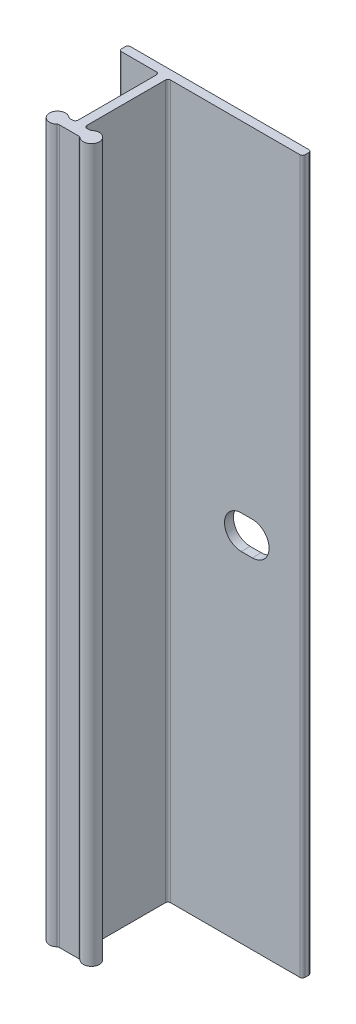
ISO-10303-21;
HEADER;
FILE_DESCRIPTION(('STEP AP214'),'2;1');
FILE_NAME('part.step','',(''),(''),'','','');
FILE_SCHEMA(('AUTOMOTIVE_DESIGN { 1 0 10303 214 1 1 1 1 }'));
ENDSEC;
DATA;
#1=APPLICATION_CONTEXT('core data for automotive mechanical design processes');
#2=APPLICATION_PROTOCOL_DEFINITION('international standard','automotive_design',2000,#1);
#3=PRODUCT_CONTEXT('',#1,'mechanical');
#4=PRODUCT('Part','Part','',(#3));
#5=PRODUCT_RELATED_PRODUCT_CATEGORY('part','',(#4));
#6=PRODUCT_DEFINITION_FORMATION('','',#4);
#7=PRODUCT_DEFINITION_CONTEXT('part definition',#1,'design');
#8=PRODUCT_DEFINITION('design','',#6,#7);
#9=PRODUCT_DEFINITION_SHAPE('','',#8);
#10=(LENGTH_UNIT() NAMED_UNIT(*) SI_UNIT(.MILLI.,.METRE.));
#11=(NAMED_UNIT(*) PLANE_ANGLE_UNIT() SI_UNIT($,.RADIAN.));
#12=(NAMED_UNIT(*) SI_UNIT($,.STERADIAN.) SOLID_ANGLE_UNIT());
#13=UNCERTAINTY_MEASURE_WITH_UNIT(LENGTH_MEASURE(1.E-05),#10,'distance_accuracy_value','');
#14=(GEOMETRIC_REPRESENTATION_CONTEXT(3) GLOBAL_UNCERTAINTY_ASSIGNED_CONTEXT((#13)) GLOBAL_UNIT_ASSIGNED_CONTEXT((#10,
#11,#12)) REPRESENTATION_CONTEXT('',''));
#15=CARTESIAN_POINT('',(0.,0.,0.));
#16=DIRECTION('',(0.,0.,1.));
#17=DIRECTION('',(1.,0.,0.));
#18=AXIS2_PLACEMENT_3D('',#15,#16,#17);
#19=CARTESIAN_POINT('',(-5.96900000000001,50.8,0.381));
#20=DIRECTION('',(0.,-1.,0.));
#21=DIRECTION('',(0.,0.,-1.));
#22=AXIS2_PLACEMENT_3D('',#19,#20,#21);
#23=CYLINDRICAL_SURFACE('',#22,0.381);
#24=CARTESIAN_POINT('',(-5.96900000000001,-50.8,0.381));
#25=DIRECTION('',(0.,1.,0.));
#26=DIRECTION('',(0.,0.,-1.));
#27=AXIS2_PLACEMENT_3D('',#24,#25,#26);
#28=CIRCLE('',#27,0.381);
#29=CARTESIAN_POINT('',(-5.96900000000001,-50.8,0.));
#30=VERTEX_POINT('',#29);
#31=CARTESIAN_POINT('',(-6.35000000000001,-50.8,0.381000000000002));
#32=VERTEX_POINT('',#31);
#33=EDGE_CURVE('E263',#30,#32,#28,.T.);
#34=ORIENTED_EDGE('',*,*,#33,.T.);
#35=DIRECTION('',(0.,-1.,0.));
#36=VECTOR('',#35,1.);
#37=CARTESIAN_POINT('',(-6.35000000000001,50.8,0.381000000000002));
#38=LINE('',#37,#36);
#39=CARTESIAN_POINT('',(-6.35000000000001,50.8,0.381000000000002));
#40=VERTEX_POINT('',#39);
#41=EDGE_CURVE('E13',#40,#32,#38,.T.);
#42=ORIENTED_EDGE('',*,*,#41,.F.);
#43=CARTESIAN_POINT('',(-5.96900000000001,50.8,0.381));
#44=DIRECTION('',(0.,1.,0.));
#45=DIRECTION('',(0.,0.,-1.));
#46=AXIS2_PLACEMENT_3D('',#43,#44,#45);
#47=CIRCLE('',#46,0.381);
#48=CARTESIAN_POINT('',(-5.96900000000001,50.8,0.));
#49=VERTEX_POINT('',#48);
#50=EDGE_CURVE('E267',#49,#40,#47,.T.);
#51=ORIENTED_EDGE('',*,*,#50,.F.);
#52=DIRECTION('',(0.,-1.,0.));
#53=VECTOR('',#52,1.);
#54=CARTESIAN_POINT('',(-5.96900000000001,50.8,0.));
#55=LINE('',#54,#53);
#56=EDGE_CURVE('E317',#49,#30,#55,.T.);
#57=ORIENTED_EDGE('',*,*,#56,.T.);
#58=EDGE_LOOP('',(#34,#42,#51,#57));
#59=FACE_BOUND('',#58,.T.);
#60=ADVANCED_FACE('F46',(#59),#23,.T.);
#61=CARTESIAN_POINT('',(-6.35000000000001,50.8,0.889000000000004));
#62=DIRECTION('',(1.,0.,0.));
#63=DIRECTION('',(0.,0.,-1.));
#64=AXIS2_PLACEMENT_3D('',#61,#62,#63);
#65=PLANE('',#64);
#66=DIRECTION('',(0.,0.,1.));
#67=VECTOR('',#66,1.);
#68=CARTESIAN_POINT('',(-6.35000000000001,-50.8,0.889000000000004));
#69=LINE('',#68,#67);
#70=CARTESIAN_POINT('',(-6.35000000000001,-50.8,0.889000000000004));
#71=VERTEX_POINT('',#70);
#72=EDGE_CURVE('E320',#32,#71,#69,.T.);
#73=ORIENTED_EDGE('',*,*,#72,.T.);
#74=DIRECTION('',(0.,-1.,0.));
#75=VECTOR('',#74,1.);
#76=CARTESIAN_POINT('',(-6.35000000000001,50.8,0.889000000000004));
#77=LINE('',#76,#75);
#78=CARTESIAN_POINT('',(-6.35000000000001,50.8,0.889000000000004));
#79=VERTEX_POINT('',#78);
#80=EDGE_CURVE('E53',#79,#71,#77,.T.);
#81=ORIENTED_EDGE('',*,*,#80,.F.);
#82=DIRECTION('',(0.,0.,1.));
#83=VECTOR('',#82,1.);
#84=CARTESIAN_POINT('',(-6.35000000000001,50.8,0.889000000000004));
#85=LINE('',#84,#83);
#86=EDGE_CURVE('E270',#40,#79,#85,.T.);
#87=ORIENTED_EDGE('',*,*,#86,.F.);
#88=ORIENTED_EDGE('',*,*,#41,.T.);
#89=EDGE_LOOP('',(#73,#81,#87,#88));
#90=FACE_BOUND('',#89,.T.);
#91=ADVANCED_FACE('F457',(#90),#65,.F.);
#92=CARTESIAN_POINT('',(-5.96900000000001,50.8,0.889000000000004));
#93=DIRECTION('',(0.,-1.,0.));
#94=DIRECTION('',(0.,0.,-1.));
#95=AXIS2_PLACEMENT_3D('',#92,#93,#94);
#96=CYLINDRICAL_SURFACE('',#95,0.381000000000001);
#97=CARTESIAN_POINT('',(-5.96900000000001,-50.8,0.889000000000004));
#98=DIRECTION('',(0.,1.,0.));
#99=DIRECTION('',(0.,0.,-1.));
#100=AXIS2_PLACEMENT_3D('',#97,#98,#99);
#101=CIRCLE('',#100,0.381000000000001);
#102=CARTESIAN_POINT('',(-5.96900000000001,-50.8,1.27000000000001));
#103=VERTEX_POINT('',#102);
#104=EDGE_CURVE('E322',#71,#103,#101,.T.);
#105=ORIENTED_EDGE('',*,*,#104,.T.);
#106=DIRECTION('',(0.,-1.,0.));
#107=VECTOR('',#106,1.);
#108=CARTESIAN_POINT('',(-5.96900000000001,50.8,1.27000000000001));
#109=LINE('',#108,#107);
#110=CARTESIAN_POINT('',(-5.96900000000001,50.8,1.27000000000001));
#111=VERTEX_POINT('',#110);
#112=EDGE_CURVE('E427',#111,#103,#109,.T.);
#113=ORIENTED_EDGE('',*,*,#112,.F.);
#114=CARTESIAN_POINT('',(-5.96900000000001,50.8,0.889000000000004));
#115=DIRECTION('',(0.,1.,0.));
#116=DIRECTION('',(0.,0.,-1.));
#117=AXIS2_PLACEMENT_3D('',#114,#115,#116);
#118=CIRCLE('',#117,0.381000000000001);
#119=EDGE_CURVE('E273',#79,#111,#118,.T.);
#120=ORIENTED_EDGE('',*,*,#119,.F.);
#121=ORIENTED_EDGE('',*,*,#80,.T.);
#122=EDGE_LOOP('',(#105,#113,#120,#121));
#123=FACE_BOUND('',#122,.T.);
#124=ADVANCED_FACE('F434',(#123),#96,.T.);
#125=CARTESIAN_POINT('',(-1.016,50.8,1.27));
#126=DIRECTION('',(0.,0.,-1.));
#127=DIRECTION('',(-1.,0.,0.));
#128=AXIS2_PLACEMENT_3D('',#125,#126,#127);
#129=PLANE('',#128);
#130=DIRECTION('',(1.,0.,0.));
#131=VECTOR('',#130,1.);
#132=CARTESIAN_POINT('',(-1.016,-50.8,1.27));
#133=LINE('',#132,#131);
#134=CARTESIAN_POINT('',(-1.016,-50.8,1.27));
#135=VERTEX_POINT('',#134);
#136=EDGE_CURVE('E324',#103,#135,#133,.T.);
#137=ORIENTED_EDGE('',*,*,#136,.T.);
#138=DIRECTION('',(0.,-1.,0.));
#139=VECTOR('',#138,1.);
#140=CARTESIAN_POINT('',(-1.016,50.8,1.27));
#141=LINE('',#140,#139);
#142=CARTESIAN_POINT('',(-1.016,50.8,1.27));
#143=VERTEX_POINT('',#142);
#144=EDGE_CURVE('E424',#143,#135,#141,.T.);
#145=ORIENTED_EDGE('',*,*,#144,.F.);
#146=DIRECTION('',(1.,0.,0.));
#147=VECTOR('',#146,1.);
#148=CARTESIAN_POINT('',(-1.016,50.8,1.27));
#149=LINE('',#148,#147);
#150=EDGE_CURVE('E275',#111,#143,#149,.T.);
#151=ORIENTED_EDGE('',*,*,#150,.F.);
#152=ORIENTED_EDGE('',*,*,#112,.T.);
#153=EDGE_LOOP('',(#137,#145,#151,#152));
#154=FACE_BOUND('',#153,.T.);
#155=ADVANCED_FACE('F445',(#154),#129,.F.);
#156=CARTESIAN_POINT('',(-1.016,50.8,1.651));
#157=DIRECTION('',(0.,-1.,0.));
#158=DIRECTION('',(0.,0.,-1.));
#159=AXIS2_PLACEMENT_3D('',#156,#157,#158);
#160=CYLINDRICAL_SURFACE('',#159,0.381);
#161=CARTESIAN_POINT('',(-1.016,-50.8,1.651));
#162=DIRECTION('',(0.,-1.,0.));
#163=DIRECTION('',(0.,0.,-1.));
#164=AXIS2_PLACEMENT_3D('',#161,#162,#163);
#165=CIRCLE('',#164,0.381);
#166=CARTESIAN_POINT('',(-0.634999999999999,-50.8,1.651));
#167=VERTEX_POINT('',#166);
#168=EDGE_CURVE('E326',#135,#167,#165,.T.);
#169=ORIENTED_EDGE('',*,*,#168,.T.);
#170=DIRECTION('',(0.,-1.,0.));
#171=VECTOR('',#170,1.);
#172=CARTESIAN_POINT('',(-0.634999999999999,50.8,1.651));
#173=LINE('',#172,#171);
#174=CARTESIAN_POINT('',(-0.634999999999999,50.8,1.651));
#175=VERTEX_POINT('',#174);
#176=EDGE_CURVE('E421',#175,#167,#173,.T.);
#177=ORIENTED_EDGE('',*,*,#176,.F.);
#178=CARTESIAN_POINT('',(-1.016,50.8,1.651));
#179=DIRECTION('',(0.,-1.,0.));
#180=DIRECTION('',(0.,0.,-1.));
#181=AXIS2_PLACEMENT_3D('',#178,#179,#180);
#182=CIRCLE('',#181,0.381);
#183=EDGE_CURVE('E277',#143,#175,#182,.T.);
#184=ORIENTED_EDGE('',*,*,#183,.F.);
#185=ORIENTED_EDGE('',*,*,#144,.T.);
#186=EDGE_LOOP('',(#169,#177,#184,#185));
#187=FACE_BOUND('',#186,.T.);
#188=ADVANCED_FACE('F449',(#187),#160,.F.);
#189=CARTESIAN_POINT('',(-0.634999999999999,50.8,1.651));
#190=DIRECTION('',(1.,0.,0.));
#191=DIRECTION('',(0.,0.,-1.));
#192=AXIS2_PLACEMENT_3D('',#189,#190,#191);
#193=PLANE('',#192);
#194=DIRECTION('',(0.,0.,1.));
#195=VECTOR('',#194,1.);
#196=CARTESIAN_POINT('',(-0.634999999999999,-50.8,1.651));
#197=LINE('',#196,#195);
#198=CARTESIAN_POINT('',(-0.634999999999998,-50.8,12.827));
#199=VERTEX_POINT('',#198);
#200=EDGE_CURVE('E328',#167,#199,#197,.T.);
#201=ORIENTED_EDGE('',*,*,#200,.T.);
#202=DIRECTION('',(0.,-1.,0.));
#203=VECTOR('',#202,1.);
#204=CARTESIAN_POINT('',(-0.634999999999998,50.8,12.827));
#205=LINE('',#204,#203);
#206=CARTESIAN_POINT('',(-0.634999999999998,50.8,12.827));
#207=VERTEX_POINT('',#206);
#208=EDGE_CURVE('E418',#207,#199,#205,.T.);
#209=ORIENTED_EDGE('',*,*,#208,.F.);
#210=DIRECTION('',(0.,0.,1.));
#211=VECTOR('',#210,1.);
#212=CARTESIAN_POINT('',(-0.634999999999999,50.8,1.651));
#213=LINE('',#212,#211);
#214=EDGE_CURVE('E279',#175,#207,#213,.T.);
#215=ORIENTED_EDGE('',*,*,#214,.F.);
#216=ORIENTED_EDGE('',*,*,#176,.T.);
#217=EDGE_LOOP('',(#201,#209,#215,#216));
#218=FACE_BOUND('',#217,.T.);
#219=ADVANCED_FACE('F548',(#218),#193,.F.);
#220=CARTESIAN_POINT('',(-1.016,50.8,12.827));
#221=DIRECTION('',(0.,-1.,0.));
#222=DIRECTION('',(0.,0.,-1.));
#223=AXIS2_PLACEMENT_3D('',#220,#221,#222);
#224=CYLINDRICAL_SURFACE('',#223,0.381);
#225=CARTESIAN_POINT('',(-1.016,-50.8,12.827));
#226=DIRECTION('',(0.,-1.,0.));
#227=DIRECTION('',(0.,0.,-1.));
#228=AXIS2_PLACEMENT_3D('',#225,#226,#227);
#229=CIRCLE('',#228,0.381);
#230=CARTESIAN_POINT('',(-1.016,-50.8,13.208));
#231=VERTEX_POINT('',#230);
#232=EDGE_CURVE('E330',#199,#231,#229,.T.);
#233=ORIENTED_EDGE('',*,*,#232,.T.);
#234=DIRECTION('',(0.,-1.,0.));
#235=VECTOR('',#234,1.);
#236=CARTESIAN_POINT('',(-1.016,50.8,13.208));
#237=LINE('',#236,#235);
#238=CARTESIAN_POINT('',(-1.016,50.8,13.208));
#239=VERTEX_POINT('',#238);
#240=EDGE_CURVE('E415',#239,#231,#237,.T.);
#241=ORIENTED_EDGE('',*,*,#240,.F.);
#242=CARTESIAN_POINT('',(-1.016,50.8,12.827));
#243=DIRECTION('',(0.,-1.,0.));
#244=DIRECTION('',(0.,0.,-1.));
#245=AXIS2_PLACEMENT_3D('',#242,#243,#244);
#246=CIRCLE('',#245,0.381);
#247=EDGE_CURVE('E281',#207,#239,#246,.T.);
#248=ORIENTED_EDGE('',*,*,#247,.F.);
#249=ORIENTED_EDGE('',*,*,#208,.T.);
#250=EDGE_LOOP('',(#233,#241,#248,#249));
#251=FACE_BOUND('',#250,.T.);
#252=ADVANCED_FACE('F546',(#251),#224,.F.);
#253=CARTESIAN_POINT('',(-1.40496875048439,50.8,13.208));
#254=DIRECTION('',(0.,0.,1.));
#255=DIRECTION('',(1.,0.,0.));
#256=AXIS2_PLACEMENT_3D('',#253,#254,#255);
#257=PLANE('',#256);
#258=DIRECTION('',(-1.,0.,0.));
#259=VECTOR('',#258,1.);
#260=CARTESIAN_POINT('',(-1.40496875048439,-50.8,13.208));
#261=LINE('',#260,#259);
#262=CARTESIAN_POINT('',(-1.40496875048439,-50.8,13.208));
#263=VERTEX_POINT('',#262);
#264=EDGE_CURVE('E332',#231,#263,#261,.T.);
#265=ORIENTED_EDGE('',*,*,#264,.T.);
#266=DIRECTION('',(0.,-1.,0.));
#267=VECTOR('',#266,1.);
#268=CARTESIAN_POINT('',(-1.40496875048439,50.8,13.208));
#269=LINE('',#268,#267);
#270=CARTESIAN_POINT('',(-1.40496875048439,50.8,13.208));
#271=VERTEX_POINT('',#270);
#272=EDGE_CURVE('E412',#271,#263,#269,.T.);
#273=ORIENTED_EDGE('',*,*,#272,.F.);
#274=DIRECTION('',(-1.,0.,0.));
#275=VECTOR('',#274,1.);
#276=CARTESIAN_POINT('',(-1.40496875048439,50.8,13.208));
#277=LINE('',#276,#275);
#278=EDGE_CURVE('E283',#239,#271,#277,.T.);
#279=ORIENTED_EDGE('',*,*,#278,.F.);
#280=ORIENTED_EDGE('',*,*,#240,.T.);
#281=EDGE_LOOP('',(#265,#273,#279,#280));
#282=FACE_BOUND('',#281,.T.);
#283=ADVANCED_FACE('F542',(#282),#257,.F.);
#284=CARTESIAN_POINT('',(-1.40496875048439,50.8,12.827));
#285=DIRECTION('',(0.,-1.,0.));
#286=DIRECTION('',(0.,0.,-1.));
#287=AXIS2_PLACEMENT_3D('',#284,#285,#286);
#288=CYLINDRICAL_SURFACE('',#287,0.381);
#289=CARTESIAN_POINT('',(-1.40496875048439,-50.8,12.827));
#290=DIRECTION('',(0.,-1.,0.));
#291=DIRECTION('',(0.,0.,-1.));
#292=AXIS2_PLACEMENT_3D('',#289,#290,#291);
#293=CIRCLE('',#292,0.381);
#294=CARTESIAN_POINT('',(-1.65697656286329,-50.8,13.11275));
#295=VERTEX_POINT('',#294);
#296=EDGE_CURVE('E334',#263,#295,#293,.T.);
#297=ORIENTED_EDGE('',*,*,#296,.T.);
#298=DIRECTION('',(0.,-1.,0.));
#299=VECTOR('',#298,1.);
#300=CARTESIAN_POINT('',(-1.65697656286329,50.8,13.11275));
#301=LINE('',#300,#299);
#302=CARTESIAN_POINT('',(-1.65697656286329,50.8,13.11275));
#303=VERTEX_POINT('',#302);
#304=EDGE_CURVE('E409',#303,#295,#301,.T.);
#305=ORIENTED_EDGE('',*,*,#304,.F.);
#306=CARTESIAN_POINT('',(-1.40496875048439,50.8,12.827));
#307=DIRECTION('',(0.,-1.,0.));
#308=DIRECTION('',(0.,0.,-1.));
#309=AXIS2_PLACEMENT_3D('',#306,#307,#308);
#310=CIRCLE('',#309,0.381);
#311=EDGE_CURVE('E285',#271,#303,#310,.T.);
#312=ORIENTED_EDGE('',*,*,#311,.F.);
#313=ORIENTED_EDGE('',*,*,#272,.T.);
#314=EDGE_LOOP('',(#297,#305,#312,#313));
#315=FACE_BOUND('',#314,.T.);
#316=ADVANCED_FACE('F537',(#315),#288,.F.);
#317=CARTESIAN_POINT('',(-2.413,50.8,13.97));
#318=DIRECTION('',(0.,-1.,0.));
#319=DIRECTION('',(0.,0.,-1.));
#320=AXIS2_PLACEMENT_3D('',#317,#318,#319);
#321=CYLINDRICAL_SURFACE('',#320,1.143);
#322=CARTESIAN_POINT('',(-2.413,-50.8,13.97));
#323=DIRECTION('',(0.,1.,0.));
#324=DIRECTION('',(0.,0.,1.));
#325=AXIS2_PLACEMENT_3D('',#322,#323,#324);
#326=CIRCLE('',#325,1.143);
#327=CARTESIAN_POINT('',(-1.65697656286329,-50.8,14.82725));
#328=VERTEX_POINT('',#327);
#329=EDGE_CURVE('E336',#295,#328,#326,.T.);
#330=ORIENTED_EDGE('',*,*,#329,.T.);
#331=DIRECTION('',(0.,-1.,0.));
#332=VECTOR('',#331,1.);
#333=CARTESIAN_POINT('',(-1.65697656286329,50.8,14.82725));
#334=LINE('',#333,#332);
#335=CARTESIAN_POINT('',(-1.65697656286329,50.8,14.82725));
#336=VERTEX_POINT('',#335);
#337=EDGE_CURVE('E406',#336,#328,#334,.T.);
#338=ORIENTED_EDGE('',*,*,#337,.F.);
#339=CARTESIAN_POINT('',(-2.413,50.8,13.97));
#340=DIRECTION('',(0.,1.,0.));
#341=DIRECTION('',(0.,0.,1.));
#342=AXIS2_PLACEMENT_3D('',#339,#340,#341);
#343=CIRCLE('',#342,1.143);
#344=EDGE_CURVE('E287',#303,#336,#343,.T.);
#345=ORIENTED_EDGE('',*,*,#344,.F.);
#346=ORIENTED_EDGE('',*,*,#304,.T.);
#347=EDGE_LOOP('',(#330,#338,#345,#346));
#348=FACE_BOUND('',#347,.T.);
#349=ADVANCED_FACE('F531',(#348),#321,.T.);
#350=CARTESIAN_POINT('',(-1.40496875048439,50.8,15.113));
#351=DIRECTION('',(0.,-1.,0.));
#352=DIRECTION('',(0.,0.,-1.));
#353=AXIS2_PLACEMENT_3D('',#350,#351,#352);
#354=CYLINDRICAL_SURFACE('',#353,0.380999999999999);
#355=CARTESIAN_POINT('',(-1.40496875048439,-50.8,15.113));
#356=DIRECTION('',(0.,-1.,0.));
#357=DIRECTION('',(0.,0.,1.));
#358=AXIS2_PLACEMENT_3D('',#355,#356,#357);
#359=CIRCLE('',#358,0.380999999999999);
#360=CARTESIAN_POINT('',(-1.40496875048439,-50.8,14.732));
#361=VERTEX_POINT('',#360);
#362=EDGE_CURVE('E338',#328,#361,#359,.T.);
#363=ORIENTED_EDGE('',*,*,#362,.T.);
#364=DIRECTION('',(0.,-1.,0.));
#365=VECTOR('',#364,1.);
#366=CARTESIAN_POINT('',(-1.40496875048439,50.8,14.732));
#367=LINE('',#366,#365);
#368=CARTESIAN_POINT('',(-1.40496875048439,50.8,14.732));
#369=VERTEX_POINT('',#368);
#370=EDGE_CURVE('E403',#369,#361,#367,.T.);
#371=ORIENTED_EDGE('',*,*,#370,.F.);
#372=CARTESIAN_POINT('',(-1.40496875048439,50.8,15.113));
#373=DIRECTION('',(0.,-1.,0.));
#374=DIRECTION('',(0.,0.,1.));
#375=AXIS2_PLACEMENT_3D('',#372,#373,#374);
#376=CIRCLE('',#375,0.380999999999999);
#377=EDGE_CURVE('E289',#336,#369,#376,.T.);
#378=ORIENTED_EDGE('',*,*,#377,.F.);
#379=ORIENTED_EDGE('',*,*,#337,.T.);
#380=EDGE_LOOP('',(#363,#371,#378,#379));
#381=FACE_BOUND('',#380,.T.);
#382=ADVANCED_FACE('F527',(#381),#354,.F.);
#383=CARTESIAN_POINT('',(-1.40496875048439,50.8,14.732));
#384=DIRECTION('',(0.,0.,-1.));
#385=DIRECTION('',(-1.,0.,0.));
#386=AXIS2_PLACEMENT_3D('',#383,#384,#385);
#387=PLANE('',#386);
#388=DIRECTION('',(1.,0.,0.));
#389=VECTOR('',#388,1.);
#390=CARTESIAN_POINT('',(-1.40496875048439,-50.8,14.732));
#391=LINE('',#390,#389);
#392=CARTESIAN_POINT('',(1.40496875048439,-50.8,14.732));
#393=VERTEX_POINT('',#392);
#394=EDGE_CURVE('E340',#361,#393,#391,.T.);
#395=ORIENTED_EDGE('',*,*,#394,.T.);
#396=DIRECTION('',(0.,-1.,0.));
#397=VECTOR('',#396,1.);
#398=CARTESIAN_POINT('',(1.40496875048439,50.8,14.732));
#399=LINE('',#398,#397);
#400=CARTESIAN_POINT('',(1.40496875048439,50.8,14.732));
#401=VERTEX_POINT('',#400);
#402=EDGE_CURVE('E400',#401,#393,#399,.T.);
#403=ORIENTED_EDGE('',*,*,#402,.F.);
#404=DIRECTION('',(1.,0.,0.));
#405=VECTOR('',#404,1.);
#406=CARTESIAN_POINT('',(-1.40496875048439,50.8,14.732));
#407=LINE('',#406,#405);
#408=EDGE_CURVE('E291',#369,#401,#407,.T.);
#409=ORIENTED_EDGE('',*,*,#408,.F.);
#410=ORIENTED_EDGE('',*,*,#370,.T.);
#411=EDGE_LOOP('',(#395,#403,#409,#410));
#412=FACE_BOUND('',#411,.T.);
#413=ADVANCED_FACE('F522',(#412),#387,.F.);
#414=CARTESIAN_POINT('',(1.40496875048439,50.8,15.113));
#415=DIRECTION('',(0.,-1.,0.));
#416=DIRECTION('',(0.,0.,-1.));
#417=AXIS2_PLACEMENT_3D('',#414,#415,#416);
#418=CYLINDRICAL_SURFACE('',#417,0.380999999999999);
#419=CARTESIAN_POINT('',(1.40496875048439,-50.8,15.113));
#420=DIRECTION('',(0.,-1.,0.));
#421=DIRECTION('',(0.,0.,-1.));
#422=AXIS2_PLACEMENT_3D('',#419,#420,#421);
#423=CIRCLE('',#422,0.380999999999999);
#424=CARTESIAN_POINT('',(1.65697656286329,-50.8,14.82725));
#425=VERTEX_POINT('',#424);
#426=EDGE_CURVE('E342',#393,#425,#423,.T.);
#427=ORIENTED_EDGE('',*,*,#426,.T.);
#428=DIRECTION('',(0.,-1.,0.));
#429=VECTOR('',#428,1.);
#430=CARTESIAN_POINT('',(1.65697656286329,50.8,14.82725));
#431=LINE('',#430,#429);
#432=CARTESIAN_POINT('',(1.65697656286329,50.8,14.82725));
#433=VERTEX_POINT('',#432);
#434=EDGE_CURVE('E397',#433,#425,#431,.T.);
#435=ORIENTED_EDGE('',*,*,#434,.F.);
#436=CARTESIAN_POINT('',(1.40496875048439,50.8,15.113));
#437=DIRECTION('',(0.,-1.,0.));
#438=DIRECTION('',(0.,0.,-1.));
#439=AXIS2_PLACEMENT_3D('',#436,#437,#438);
#440=CIRCLE('',#439,0.380999999999999);
#441=EDGE_CURVE('E293',#401,#433,#440,.T.);
#442=ORIENTED_EDGE('',*,*,#441,.F.);
#443=ORIENTED_EDGE('',*,*,#402,.T.);
#444=EDGE_LOOP('',(#427,#435,#442,#443));
#445=FACE_BOUND('',#444,.T.);
#446=ADVANCED_FACE('F516',(#445),#418,.F.);
#447=CARTESIAN_POINT('',(2.413,50.8,13.97));
#448=DIRECTION('',(0.,-1.,0.));
#449=DIRECTION('',(0.,0.,-1.));
#450=AXIS2_PLACEMENT_3D('',#447,#448,#449);
#451=CYLINDRICAL_SURFACE('',#450,1.143);
#452=CARTESIAN_POINT('',(2.413,-50.8,13.97));
#453=DIRECTION('',(0.,1.,0.));
#454=DIRECTION('',(0.,0.,1.));
#455=AXIS2_PLACEMENT_3D('',#452,#453,#454);
#456=CIRCLE('',#455,1.143);
#457=CARTESIAN_POINT('',(1.6569765628633,-50.8,13.11275));
#458=VERTEX_POINT('',#457);
#459=EDGE_CURVE('E344',#425,#458,#456,.T.);
#460=ORIENTED_EDGE('',*,*,#459,.T.);
#461=DIRECTION('',(0.,-1.,0.));
#462=VECTOR('',#461,1.);
#463=CARTESIAN_POINT('',(1.6569765628633,50.8,13.11275));
#464=LINE('',#463,#462);
#465=CARTESIAN_POINT('',(1.6569765628633,50.8,13.11275));
#466=VERTEX_POINT('',#465);
#467=EDGE_CURVE('E394',#466,#458,#464,.T.);
#468=ORIENTED_EDGE('',*,*,#467,.F.);
#469=CARTESIAN_POINT('',(2.413,50.8,13.97));
#470=DIRECTION('',(0.,1.,0.));
#471=DIRECTION('',(0.,0.,1.));
#472=AXIS2_PLACEMENT_3D('',#469,#470,#471);
#473=CIRCLE('',#472,1.143);
#474=EDGE_CURVE('E295',#433,#466,#473,.T.);
#475=ORIENTED_EDGE('',*,*,#474,.F.);
#476=ORIENTED_EDGE('',*,*,#434,.T.);
#477=EDGE_LOOP('',(#460,#468,#475,#476));
#478=FACE_BOUND('',#477,.T.);
#479=ADVANCED_FACE('F512',(#478),#451,.T.);
#480=CARTESIAN_POINT('',(1.40496875048439,50.8,12.827));
#481=DIRECTION('',(0.,-1.,0.));
#482=DIRECTION('',(0.,0.,-1.));
#483=AXIS2_PLACEMENT_3D('',#480,#481,#482);
#484=CYLINDRICAL_SURFACE('',#483,0.381);
#485=CARTESIAN_POINT('',(1.40496875048439,-50.8,12.827));
#486=DIRECTION('',(0.,-1.,0.));
#487=DIRECTION('',(0.,0.,-1.));
#488=AXIS2_PLACEMENT_3D('',#485,#486,#487);
#489=CIRCLE('',#488,0.381);
#490=CARTESIAN_POINT('',(1.40496875048439,-50.8,13.208));
#491=VERTEX_POINT('',#490);
#492=EDGE_CURVE('E346',#458,#491,#489,.T.);
#493=ORIENTED_EDGE('',*,*,#492,.T.);
#494=DIRECTION('',(0.,-1.,0.));
#495=VECTOR('',#494,1.);
#496=CARTESIAN_POINT('',(1.40496875048439,50.8,13.208));
#497=LINE('',#496,#495);
#498=CARTESIAN_POINT('',(1.40496875048439,50.8,13.208));
#499=VERTEX_POINT('',#498);
#500=EDGE_CURVE('E391',#499,#491,#497,.T.);
#501=ORIENTED_EDGE('',*,*,#500,.F.);
#502=CARTESIAN_POINT('',(1.40496875048439,50.8,12.827));
#503=DIRECTION('',(0.,-1.,0.));
#504=DIRECTION('',(0.,0.,-1.));
#505=AXIS2_PLACEMENT_3D('',#502,#503,#504);
#506=CIRCLE('',#505,0.381);
#507=EDGE_CURVE('E297',#466,#499,#506,.T.);
#508=ORIENTED_EDGE('',*,*,#507,.F.);
#509=ORIENTED_EDGE('',*,*,#467,.T.);
#510=EDGE_LOOP('',(#493,#501,#508,#509));
#511=FACE_BOUND('',#510,.T.);
#512=ADVANCED_FACE('F507',(#511),#484,.F.);
#513=CARTESIAN_POINT('',(1.016,50.8,13.208));
#514=DIRECTION('',(0.,0.,1.));
#515=DIRECTION('',(1.,0.,0.));
#516=AXIS2_PLACEMENT_3D('',#513,#514,#515);
#517=PLANE('',#516);
#518=DIRECTION('',(-1.,0.,0.));
#519=VECTOR('',#518,1.);
#520=CARTESIAN_POINT('',(1.016,-50.8,13.208));
#521=LINE('',#520,#519);
#522=CARTESIAN_POINT('',(1.016,-50.8,13.208));
#523=VERTEX_POINT('',#522);
#524=EDGE_CURVE('E348',#491,#523,#521,.T.);
#525=ORIENTED_EDGE('',*,*,#524,.T.);
#526=DIRECTION('',(0.,-1.,0.));
#527=VECTOR('',#526,1.);
#528=CARTESIAN_POINT('',(1.016,50.8,13.208));
#529=LINE('',#528,#527);
#530=CARTESIAN_POINT('',(1.016,50.8,13.208));
#531=VERTEX_POINT('',#530);
#532=EDGE_CURVE('E388',#531,#523,#529,.T.);
#533=ORIENTED_EDGE('',*,*,#532,.F.);
#534=DIRECTION('',(-1.,0.,0.));
#535=VECTOR('',#534,1.);
#536=CARTESIAN_POINT('',(1.016,50.8,13.208));
#537=LINE('',#536,#535);
#538=EDGE_CURVE('E299',#499,#531,#537,.T.);
#539=ORIENTED_EDGE('',*,*,#538,.F.);
#540=ORIENTED_EDGE('',*,*,#500,.T.);
#541=EDGE_LOOP('',(#525,#533,#539,#540));
#542=FACE_BOUND('',#541,.T.);
#543=ADVANCED_FACE('F501',(#542),#517,.F.);
#544=CARTESIAN_POINT('',(1.016,50.8,12.827));
#545=DIRECTION('',(0.,-1.,0.));
#546=DIRECTION('',(0.,0.,-1.));
#547=AXIS2_PLACEMENT_3D('',#544,#545,#546);
#548=CYLINDRICAL_SURFACE('',#547,0.381);
#549=CARTESIAN_POINT('',(1.016,-50.8,12.827));
#550=DIRECTION('',(0.,-1.,0.));
#551=DIRECTION('',(0.,0.,1.));
#552=AXIS2_PLACEMENT_3D('',#549,#550,#551);
#553=CIRCLE('',#552,0.381);
#554=CARTESIAN_POINT('',(0.635000000000003,-50.8,12.827));
#555=VERTEX_POINT('',#554);
#556=EDGE_CURVE('E350',#523,#555,#553,.T.);
#557=ORIENTED_EDGE('',*,*,#556,.T.);
#558=DIRECTION('',(0.,-1.,0.));
#559=VECTOR('',#558,1.);
#560=CARTESIAN_POINT('',(0.635000000000003,50.8,12.827));
#561=LINE('',#560,#559);
#562=CARTESIAN_POINT('',(0.635000000000003,50.8,12.827));
#563=VERTEX_POINT('',#562);
#564=EDGE_CURVE('E385',#563,#555,#561,.T.);
#565=ORIENTED_EDGE('',*,*,#564,.F.);
#566=CARTESIAN_POINT('',(1.016,50.8,12.827));
#567=DIRECTION('',(0.,-1.,0.));
#568=DIRECTION('',(0.,0.,1.));
#569=AXIS2_PLACEMENT_3D('',#566,#567,#568);
#570=CIRCLE('',#569,0.381);
#571=EDGE_CURVE('E301',#531,#563,#570,.T.);
#572=ORIENTED_EDGE('',*,*,#571,.F.);
#573=ORIENTED_EDGE('',*,*,#532,.T.);
#574=EDGE_LOOP('',(#557,#565,#572,#573));
#575=FACE_BOUND('',#574,.T.);
#576=ADVANCED_FACE('F497',(#575),#548,.F.);
#577=CARTESIAN_POINT('',(0.635000000000001,50.8,1.651));
#578=DIRECTION('',(-1.,0.,0.));
#579=DIRECTION('',(0.,0.,1.));
#580=AXIS2_PLACEMENT_3D('',#577,#578,#579);
#581=PLANE('',#580);
#582=DIRECTION('',(0.,0.,-1.));
#583=VECTOR('',#582,1.);
#584=CARTESIAN_POINT('',(0.635000000000001,-50.8,1.651));
#585=LINE('',#584,#583);
#586=CARTESIAN_POINT('',(0.635000000000001,-50.8,1.651));
#587=VERTEX_POINT('',#586);
#588=EDGE_CURVE('E352',#555,#587,#585,.T.);
#589=ORIENTED_EDGE('',*,*,#588,.T.);
#590=DIRECTION('',(0.,-1.,0.));
#591=VECTOR('',#590,1.);
#592=CARTESIAN_POINT('',(0.635000000000001,50.8,1.651));
#593=LINE('',#592,#591);
#594=CARTESIAN_POINT('',(0.635000000000001,50.8,1.651));
#595=VERTEX_POINT('',#594);
#596=EDGE_CURVE('E382',#595,#587,#593,.T.);
#597=ORIENTED_EDGE('',*,*,#596,.F.);
#598=DIRECTION('',(0.,0.,-1.));
#599=VECTOR('',#598,1.);
#600=CARTESIAN_POINT('',(0.635000000000001,50.8,1.651));
#601=LINE('',#600,#599);
#602=EDGE_CURVE('E303',#563,#595,#601,.T.);
#603=ORIENTED_EDGE('',*,*,#602,.F.);
#604=ORIENTED_EDGE('',*,*,#564,.T.);
#605=EDGE_LOOP('',(#589,#597,#603,#604));
#606=FACE_BOUND('',#605,.T.);
#607=ADVANCED_FACE('F492',(#606),#581,.F.);
#608=CARTESIAN_POINT('',(1.016,50.8,1.651));
#609=DIRECTION('',(0.,-1.,0.));
#610=DIRECTION('',(0.,0.,-1.));
#611=AXIS2_PLACEMENT_3D('',#608,#609,#610);
#612=CYLINDRICAL_SURFACE('',#611,0.381000000000001);
#613=CARTESIAN_POINT('',(1.016,-50.8,1.651));
#614=DIRECTION('',(0.,-1.,0.));
#615=DIRECTION('',(0.,0.,1.));
#616=AXIS2_PLACEMENT_3D('',#613,#614,#615);
#617=CIRCLE('',#616,0.381000000000001);
#618=CARTESIAN_POINT('',(1.016,-50.8,1.27));
#619=VERTEX_POINT('',#618);
#620=EDGE_CURVE('E354',#587,#619,#617,.T.);
#621=ORIENTED_EDGE('',*,*,#620,.T.);
#622=DIRECTION('',(0.,-1.,0.));
#623=VECTOR('',#622,1.);
#624=CARTESIAN_POINT('',(1.016,50.8,1.27));
#625=LINE('',#624,#623);
#626=CARTESIAN_POINT('',(1.016,50.8,1.27));
#627=VERTEX_POINT('',#626);
#628=EDGE_CURVE('E379',#627,#619,#625,.T.);
#629=ORIENTED_EDGE('',*,*,#628,.F.);
#630=CARTESIAN_POINT('',(1.016,50.8,1.651));
#631=DIRECTION('',(0.,-1.,0.));
#632=DIRECTION('',(0.,0.,1.));
#633=AXIS2_PLACEMENT_3D('',#630,#631,#632);
#634=CIRCLE('',#633,0.381000000000001);
#635=EDGE_CURVE('E305',#595,#627,#634,.T.);
#636=ORIENTED_EDGE('',*,*,#635,.F.);
#637=ORIENTED_EDGE('',*,*,#596,.T.);
#638=EDGE_LOOP('',(#621,#629,#636,#637));
#639=FACE_BOUND('',#638,.T.);
#640=ADVANCED_FACE('F486',(#639),#612,.F.);
#641=CARTESIAN_POINT('',(19.431,50.8,1.27));
#642=DIRECTION('',(0.,0.,-1.));
#643=DIRECTION('',(-1.,0.,0.));
#644=AXIS2_PLACEMENT_3D('',#641,#642,#643);
#645=PLANE('',#644);
#646=DIRECTION('',(1.,0.,0.));
#647=VECTOR('',#646,1.);
#648=CARTESIAN_POINT('',(11.08075,-2.38125,1.27));
#649=LINE('',#648,#647);
#650=CARTESIAN_POINT('',(11.08075,-2.38125,1.27));
#651=VERTEX_POINT('',#650);
#652=CARTESIAN_POINT('',(12.66825,-2.38125,1.27));
#653=VERTEX_POINT('',#652);
#654=EDGE_CURVE('E257',#651,#653,#649,.T.);
#655=ORIENTED_EDGE('',*,*,#654,.F.);
#656=CARTESIAN_POINT('',(11.08075,0.,1.27));
#657=DIRECTION('',(0.,0.,1.));
#658=DIRECTION('',(1.,0.,0.));
#659=AXIS2_PLACEMENT_3D('',#656,#657,#658);
#660=CIRCLE('',#659,2.38125);
#661=CARTESIAN_POINT('',(11.08075,2.38125,1.27));
#662=VERTEX_POINT('',#661);
#663=EDGE_CURVE('E60',#662,#651,#660,.T.);
#664=ORIENTED_EDGE('',*,*,#663,.F.);
#665=DIRECTION('',(-1.,0.,0.));
#666=VECTOR('',#665,1.);
#667=CARTESIAN_POINT('',(11.08075,2.38125,1.27));
#668=LINE('',#667,#666);
#669=CARTESIAN_POINT('',(12.66825,2.38125,1.27));
#670=VERTEX_POINT('',#669);
#671=EDGE_CURVE('E248',#670,#662,#668,.T.);
#672=ORIENTED_EDGE('',*,*,#671,.F.);
#673=CARTESIAN_POINT('',(12.66825,0.,1.27));
#674=DIRECTION('',(0.,0.,1.));
#675=DIRECTION('',(1.,0.,0.));
#676=AXIS2_PLACEMENT_3D('',#673,#674,#675);
#677=CIRCLE('',#676,2.38125);
#678=EDGE_CURVE('E251',#653,#670,#677,.T.);
#679=ORIENTED_EDGE('',*,*,#678,.F.);
#680=EDGE_LOOP('',(#655,#664,#672,#679));
#681=FACE_BOUND('',#680,.T.);
#682=DIRECTION('',(1.,0.,0.));
#683=VECTOR('',#682,1.);
#684=CARTESIAN_POINT('',(19.431,-50.8,1.27));
#685=LINE('',#684,#683);
#686=CARTESIAN_POINT('',(19.431,-50.8,1.27));
#687=VERTEX_POINT('',#686);
#688=EDGE_CURVE('E356',#619,#687,#685,.T.);
#689=ORIENTED_EDGE('',*,*,#688,.T.);
#690=DIRECTION('',(0.,-1.,0.));
#691=VECTOR('',#690,1.);
#692=CARTESIAN_POINT('',(19.431,50.8,1.27));
#693=LINE('',#692,#691);
#694=CARTESIAN_POINT('',(19.431,50.8,1.27));
#695=VERTEX_POINT('',#694);
#696=EDGE_CURVE('E376',#695,#687,#693,.T.);
#697=ORIENTED_EDGE('',*,*,#696,.F.);
#698=DIRECTION('',(1.,0.,0.));
#699=VECTOR('',#698,1.);
#700=CARTESIAN_POINT('',(19.431,50.8,1.27));
#701=LINE('',#700,#699);
#702=EDGE_CURVE('E307',#627,#695,#701,.T.);
#703=ORIENTED_EDGE('',*,*,#702,.F.);
#704=ORIENTED_EDGE('',*,*,#628,.T.);
#705=EDGE_LOOP('',(#689,#697,#703,#704));
#706=FACE_BOUND('',#705,.T.);
#707=ADVANCED_FACE('F482',(#681,#706),#645,.F.);
#708=CARTESIAN_POINT('',(19.431,50.8,0.889));
#709=DIRECTION('',(0.,-1.,0.));
#710=DIRECTION('',(0.,0.,-1.));
#711=AXIS2_PLACEMENT_3D('',#708,#709,#710);
#712=CYLINDRICAL_SURFACE('',#711,0.381000000000002);
#713=CARTESIAN_POINT('',(19.431,-50.8,0.889));
#714=DIRECTION('',(0.,1.,0.));
#715=DIRECTION('',(0.,0.,-1.));
#716=AXIS2_PLACEMENT_3D('',#713,#714,#715);
#717=CIRCLE('',#716,0.381000000000002);
#718=CARTESIAN_POINT('',(19.812,-50.8,0.889));
#719=VERTEX_POINT('',#718);
#720=EDGE_CURVE('E358',#687,#719,#717,.T.);
#721=ORIENTED_EDGE('',*,*,#720,.T.);
#722=DIRECTION('',(0.,-1.,0.));
#723=VECTOR('',#722,1.);
#724=CARTESIAN_POINT('',(19.812,50.8,0.889));
#725=LINE('',#724,#723);
#726=CARTESIAN_POINT('',(19.812,50.8,0.889));
#727=VERTEX_POINT('',#726);
#728=EDGE_CURVE('E373',#727,#719,#725,.T.);
#729=ORIENTED_EDGE('',*,*,#728,.F.);
#730=CARTESIAN_POINT('',(19.431,50.8,0.889));
#731=DIRECTION('',(0.,1.,0.));
#732=DIRECTION('',(0.,0.,-1.));
#733=AXIS2_PLACEMENT_3D('',#730,#731,#732);
#734=CIRCLE('',#733,0.381000000000002);
#735=EDGE_CURVE('E309',#695,#727,#734,.T.);
#736=ORIENTED_EDGE('',*,*,#735,.F.);
#737=ORIENTED_EDGE('',*,*,#696,.T.);
#738=EDGE_LOOP('',(#721,#729,#736,#737));
#739=FACE_BOUND('',#738,.T.);
#740=ADVANCED_FACE('F477',(#739),#712,.T.);
#741=CARTESIAN_POINT('',(19.812,50.8,0.381));
#742=DIRECTION('',(-1.,0.,0.));
#743=DIRECTION('',(0.,0.,1.));
#744=AXIS2_PLACEMENT_3D('',#741,#742,#743);
#745=PLANE('',#744);
#746=DIRECTION('',(0.,0.,-1.));
#747=VECTOR('',#746,1.);
#748=CARTESIAN_POINT('',(19.812,-50.8,0.381));
#749=LINE('',#748,#747);
#750=CARTESIAN_POINT('',(19.812,-50.8,0.381));
#751=VERTEX_POINT('',#750);
#752=EDGE_CURVE('E360',#719,#751,#749,.T.);
#753=ORIENTED_EDGE('',*,*,#752,.T.);
#754=DIRECTION('',(0.,-1.,0.));
#755=VECTOR('',#754,1.);
#756=CARTESIAN_POINT('',(19.812,50.8,0.381));
#757=LINE('',#756,#755);
#758=CARTESIAN_POINT('',(19.812,50.8,0.381));
#759=VERTEX_POINT('',#758);
#760=EDGE_CURVE('E370',#759,#751,#757,.T.);
#761=ORIENTED_EDGE('',*,*,#760,.F.);
#762=DIRECTION('',(0.,0.,-1.));
#763=VECTOR('',#762,1.);
#764=CARTESIAN_POINT('',(19.812,50.8,0.381));
#765=LINE('',#764,#763);
#766=EDGE_CURVE('E311',#727,#759,#765,.T.);
#767=ORIENTED_EDGE('',*,*,#766,.F.);
#768=ORIENTED_EDGE('',*,*,#728,.T.);
#769=EDGE_LOOP('',(#753,#761,#767,#768));
#770=FACE_BOUND('',#769,.T.);
#771=ADVANCED_FACE('F471',(#770),#745,.F.);
#772=CARTESIAN_POINT('',(19.431,50.8,0.381));
#773=DIRECTION('',(0.,-1.,0.));
#774=DIRECTION('',(0.,0.,-1.));
#775=AXIS2_PLACEMENT_3D('',#772,#773,#774);
#776=CYLINDRICAL_SURFACE('',#775,0.381000000000002);
#777=CARTESIAN_POINT('',(19.431,-50.8,0.381));
#778=DIRECTION('',(0.,1.,0.));
#779=DIRECTION('',(0.,0.,-1.));
#780=AXIS2_PLACEMENT_3D('',#777,#778,#779);
#781=CIRCLE('',#780,0.381000000000002);
#782=CARTESIAN_POINT('',(19.431,-50.8,0.));
#783=VERTEX_POINT('',#782);
#784=EDGE_CURVE('E362',#751,#783,#781,.T.);
#785=ORIENTED_EDGE('',*,*,#784,.T.);
#786=DIRECTION('',(0.,-1.,0.));
#787=VECTOR('',#786,1.);
#788=CARTESIAN_POINT('',(19.431,50.8,0.));
#789=LINE('',#788,#787);
#790=CARTESIAN_POINT('',(19.431,50.8,0.));
#791=VERTEX_POINT('',#790);
#792=EDGE_CURVE('E367',#791,#783,#789,.T.);
#793=ORIENTED_EDGE('',*,*,#792,.F.);
#794=CARTESIAN_POINT('',(19.431,50.8,0.381));
#795=DIRECTION('',(0.,1.,0.));
#796=DIRECTION('',(0.,0.,-1.));
#797=AXIS2_PLACEMENT_3D('',#794,#795,#796);
#798=CIRCLE('',#797,0.381000000000002);
#799=EDGE_CURVE('E313',#759,#791,#798,.T.);
#800=ORIENTED_EDGE('',*,*,#799,.F.);
#801=ORIENTED_EDGE('',*,*,#760,.T.);
#802=EDGE_LOOP('',(#785,#793,#800,#801));
#803=FACE_BOUND('',#802,.T.);
#804=ADVANCED_FACE('F467',(#803),#776,.T.);
#805=CARTESIAN_POINT('',(-5.96900000000001,50.8,0.));
#806=DIRECTION('',(0.,0.,1.));
#807=DIRECTION('',(1.,0.,0.));
#808=AXIS2_PLACEMENT_3D('',#805,#806,#807);
#809=PLANE('',#808);
#810=DIRECTION('',(-1.,0.,0.));
#811=VECTOR('',#810,1.);
#812=CARTESIAN_POINT('',(11.08075,2.38125,0.));
#813=LINE('',#812,#811);
#814=CARTESIAN_POINT('',(12.66825,2.38125,0.));
#815=VERTEX_POINT('',#814);
#816=CARTESIAN_POINT('',(11.08075,2.38125,0.));
#817=VERTEX_POINT('',#816);
#818=EDGE_CURVE('E238',#815,#817,#813,.T.);
#819=ORIENTED_EDGE('',*,*,#818,.T.);
#820=CARTESIAN_POINT('',(11.08075,0.,0.));
#821=DIRECTION('',(0.,0.,1.));
#822=DIRECTION('',(1.,0.,0.));
#823=AXIS2_PLACEMENT_3D('',#820,#821,#822);
#824=CIRCLE('',#823,2.38125);
#825=CARTESIAN_POINT('',(11.08075,-2.38125,0.));
#826=VERTEX_POINT('',#825);
#827=EDGE_CURVE('E232',#817,#826,#824,.T.);
#828=ORIENTED_EDGE('',*,*,#827,.T.);
#829=DIRECTION('',(1.,0.,0.));
#830=VECTOR('',#829,1.);
#831=CARTESIAN_POINT('',(11.08075,-2.38125,0.));
#832=LINE('',#831,#830);
#833=CARTESIAN_POINT('',(12.66825,-2.38125,0.));
#834=VERTEX_POINT('',#833);
#835=EDGE_CURVE('E241',#826,#834,#832,.T.);
#836=ORIENTED_EDGE('',*,*,#835,.T.);
#837=CARTESIAN_POINT('',(12.66825,0.,0.));
#838=DIRECTION('',(0.,0.,1.));
#839=DIRECTION('',(1.,0.,0.));
#840=AXIS2_PLACEMENT_3D('',#837,#838,#839);
#841=CIRCLE('',#840,2.38125);
#842=EDGE_CURVE('E68',#834,#815,#841,.T.);
#843=ORIENTED_EDGE('',*,*,#842,.T.);
#844=EDGE_LOOP('',(#819,#828,#836,#843));
#845=FACE_BOUND('',#844,.T.);
#846=DIRECTION('',(-1.,0.,0.));
#847=VECTOR('',#846,1.);
#848=CARTESIAN_POINT('',(-5.96900000000001,-50.8,0.));
#849=LINE('',#848,#847);
#850=EDGE_CURVE('E271',#783,#30,#849,.T.);
#851=ORIENTED_EDGE('',*,*,#850,.T.);
#852=ORIENTED_EDGE('',*,*,#56,.F.);
#853=DIRECTION('',(-1.,0.,0.));
#854=VECTOR('',#853,1.);
#855=CARTESIAN_POINT('',(-5.96900000000001,50.8,0.));
#856=LINE('',#855,#854);
#857=EDGE_CURVE('E315',#791,#49,#856,.T.);
#858=ORIENTED_EDGE('',*,*,#857,.F.);
#859=ORIENTED_EDGE('',*,*,#792,.T.);
#860=EDGE_LOOP('',(#851,#852,#858,#859));
#861=FACE_BOUND('',#860,.T.);
#862=ADVANCED_FACE('F245',(#845,#861),#809,.F.);
#863=CARTESIAN_POINT('',(-5.96900000000001,50.8,0.381));
#864=DIRECTION('',(0.,-1.,0.));
#865=DIRECTION('',(0.,0.,-1.));
#866=AXIS2_PLACEMENT_3D('',#863,#864,#865);
#867=PLANE('',#866);
#868=ORIENTED_EDGE('',*,*,#50,.T.);
#869=ORIENTED_EDGE('',*,*,#86,.T.);
#870=ORIENTED_EDGE('',*,*,#119,.T.);
#871=ORIENTED_EDGE('',*,*,#150,.T.);
#872=ORIENTED_EDGE('',*,*,#183,.T.);
#873=ORIENTED_EDGE('',*,*,#214,.T.);
#874=ORIENTED_EDGE('',*,*,#247,.T.);
#875=ORIENTED_EDGE('',*,*,#278,.T.);
#876=ORIENTED_EDGE('',*,*,#311,.T.);
#877=ORIENTED_EDGE('',*,*,#344,.T.);
#878=ORIENTED_EDGE('',*,*,#377,.T.);
#879=ORIENTED_EDGE('',*,*,#408,.T.);
#880=ORIENTED_EDGE('',*,*,#441,.T.);
#881=ORIENTED_EDGE('',*,*,#474,.T.);
#882=ORIENTED_EDGE('',*,*,#507,.T.);
#883=ORIENTED_EDGE('',*,*,#538,.T.);
#884=ORIENTED_EDGE('',*,*,#571,.T.);
#885=ORIENTED_EDGE('',*,*,#602,.T.);
#886=ORIENTED_EDGE('',*,*,#635,.T.);
#887=ORIENTED_EDGE('',*,*,#702,.T.);
#888=ORIENTED_EDGE('',*,*,#735,.T.);
#889=ORIENTED_EDGE('',*,*,#766,.T.);
#890=ORIENTED_EDGE('',*,*,#799,.T.);
#891=ORIENTED_EDGE('',*,*,#857,.T.);
#892=EDGE_LOOP('',(#868,#869,#870,#871,#872,#873,#874,#875,#876,#877,#878,#879,#880,#881,#882,
#883,#884,#885,#886,#887,#888,#889,#890,#891));
#893=FACE_BOUND('',#892,.T.);
#894=ADVANCED_FACE('F453',(#893),#867,.F.);
#895=CARTESIAN_POINT('',(-5.96900000000001,-50.8,0.381));
#896=DIRECTION('',(0.,-1.,0.));
#897=DIRECTION('',(0.,0.,-1.));
#898=AXIS2_PLACEMENT_3D('',#895,#896,#897);
#899=PLANE('',#898);
#900=ORIENTED_EDGE('',*,*,#33,.F.);
#901=ORIENTED_EDGE('',*,*,#850,.F.);
#902=ORIENTED_EDGE('',*,*,#784,.F.);
#903=ORIENTED_EDGE('',*,*,#752,.F.);
#904=ORIENTED_EDGE('',*,*,#720,.F.);
#905=ORIENTED_EDGE('',*,*,#688,.F.);
#906=ORIENTED_EDGE('',*,*,#620,.F.);
#907=ORIENTED_EDGE('',*,*,#588,.F.);
#908=ORIENTED_EDGE('',*,*,#556,.F.);
#909=ORIENTED_EDGE('',*,*,#524,.F.);
#910=ORIENTED_EDGE('',*,*,#492,.F.);
#911=ORIENTED_EDGE('',*,*,#459,.F.);
#912=ORIENTED_EDGE('',*,*,#426,.F.);
#913=ORIENTED_EDGE('',*,*,#394,.F.);
#914=ORIENTED_EDGE('',*,*,#362,.F.);
#915=ORIENTED_EDGE('',*,*,#329,.F.);
#916=ORIENTED_EDGE('',*,*,#296,.F.);
#917=ORIENTED_EDGE('',*,*,#264,.F.);
#918=ORIENTED_EDGE('',*,*,#232,.F.);
#919=ORIENTED_EDGE('',*,*,#200,.F.);
#920=ORIENTED_EDGE('',*,*,#168,.F.);
#921=ORIENTED_EDGE('',*,*,#136,.F.);
#922=ORIENTED_EDGE('',*,*,#104,.F.);
#923=ORIENTED_EDGE('',*,*,#72,.F.);
#924=EDGE_LOOP('',(#900,#901,#902,#903,#904,#905,#906,#907,#908,#909,#910,#911,#912,#913,#914,
#915,#916,#917,#918,#919,#920,#921,#922,#923));
#925=FACE_BOUND('',#924,.T.);
#926=ADVANCED_FACE('F440',(#925),#899,.T.);
#927=CARTESIAN_POINT('',(11.08075,0.,0.));
#928=DIRECTION('',(0.,0.,1.));
#929=DIRECTION('',(1.,0.,0.));
#930=AXIS2_PLACEMENT_3D('',#927,#928,#929);
#931=CYLINDRICAL_SURFACE('',#930,2.38125);
#932=ORIENTED_EDGE('',*,*,#663,.T.);
#933=DIRECTION('',(0.,0.,1.));
#934=VECTOR('',#933,1.);
#935=CARTESIAN_POINT('',(11.08075,-2.38125,0.));
#936=LINE('',#935,#934);
#937=EDGE_CURVE('E228',#826,#651,#936,.T.);
#938=ORIENTED_EDGE('',*,*,#937,.F.);
#939=ORIENTED_EDGE('',*,*,#827,.F.);
#940=DIRECTION('',(0.,0.,1.));
#941=VECTOR('',#940,1.);
#942=CARTESIAN_POINT('',(11.08075,2.38125,0.));
#943=LINE('',#942,#941);
#944=EDGE_CURVE('E261',#817,#662,#943,.T.);
#945=ORIENTED_EDGE('',*,*,#944,.T.);
#946=EDGE_LOOP('',(#932,#938,#939,#945));
#947=FACE_BOUND('',#946,.T.);
#948=ADVANCED_FACE('F230',(#947),#931,.F.);
#949=CARTESIAN_POINT('',(11.08075,2.38125,0.));
#950=DIRECTION('',(0.,1.,0.));
#951=DIRECTION('',(-1.,0.,0.));
#952=AXIS2_PLACEMENT_3D('',#949,#950,#951);
#953=PLANE('',#952);
#954=ORIENTED_EDGE('',*,*,#671,.T.);
#955=ORIENTED_EDGE('',*,*,#944,.F.);
#956=ORIENTED_EDGE('',*,*,#818,.F.);
#957=DIRECTION('',(0.,0.,1.));
#958=VECTOR('',#957,1.);
#959=CARTESIAN_POINT('',(12.66825,2.38125,0.));
#960=LINE('',#959,#958);
#961=EDGE_CURVE('E264',#815,#670,#960,.T.);
#962=ORIENTED_EDGE('',*,*,#961,.T.);
#963=EDGE_LOOP('',(#954,#955,#956,#962));
#964=FACE_BOUND('',#963,.T.);
#965=ADVANCED_FACE('F747',(#964),#953,.F.);
#966=CARTESIAN_POINT('',(12.66825,0.,0.));
#967=DIRECTION('',(0.,0.,1.));
#968=DIRECTION('',(1.,0.,0.));
#969=AXIS2_PLACEMENT_3D('',#966,#967,#968);
#970=CYLINDRICAL_SURFACE('',#969,2.38125);
#971=ORIENTED_EDGE('',*,*,#678,.T.);
#972=ORIENTED_EDGE('',*,*,#961,.F.);
#973=ORIENTED_EDGE('',*,*,#842,.F.);
#974=DIRECTION('',(0.,0.,1.));
#975=VECTOR('',#974,1.);
#976=CARTESIAN_POINT('',(12.66825,-2.38125,0.));
#977=LINE('',#976,#975);
#978=EDGE_CURVE('E237',#834,#653,#977,.T.);
#979=ORIENTED_EDGE('',*,*,#978,.T.);
#980=EDGE_LOOP('',(#971,#972,#973,#979));
#981=FACE_BOUND('',#980,.T.);
#982=ADVANCED_FACE('F756',(#981),#970,.F.);
#983=CARTESIAN_POINT('',(11.08075,-2.38125,0.));
#984=DIRECTION('',(0.,-1.,0.));
#985=DIRECTION('',(1.,0.,0.));
#986=AXIS2_PLACEMENT_3D('',#983,#984,#985);
#987=PLANE('',#986);
#988=ORIENTED_EDGE('',*,*,#654,.T.);
#989=ORIENTED_EDGE('',*,*,#978,.F.);
#990=ORIENTED_EDGE('',*,*,#835,.F.);
#991=ORIENTED_EDGE('',*,*,#937,.T.);
#992=EDGE_LOOP('',(#988,#989,#990,#991));
#993=FACE_BOUND('',#992,.T.);
#994=ADVANCED_FACE('F242',(#993),#987,.F.);
#995=CLOSED_SHELL('',(#60,#91,#124,#155,#188,#219,#252,#283,#316,#349,#382,#413,#446,#479,#512,
#543,#576,#607,#640,#707,#740,#771,#804,#862,#894,#926,#948,#965,#982,#994));
#996=MANIFOLD_SOLID_BREP('B2',#995);
#997=ADVANCED_BREP_SHAPE_REPRESENTATION('',(#18,#996),#14);
#998=SHAPE_DEFINITION_REPRESENTATION(#9,#997);
ENDSEC;
END-ISO-10303-21;
